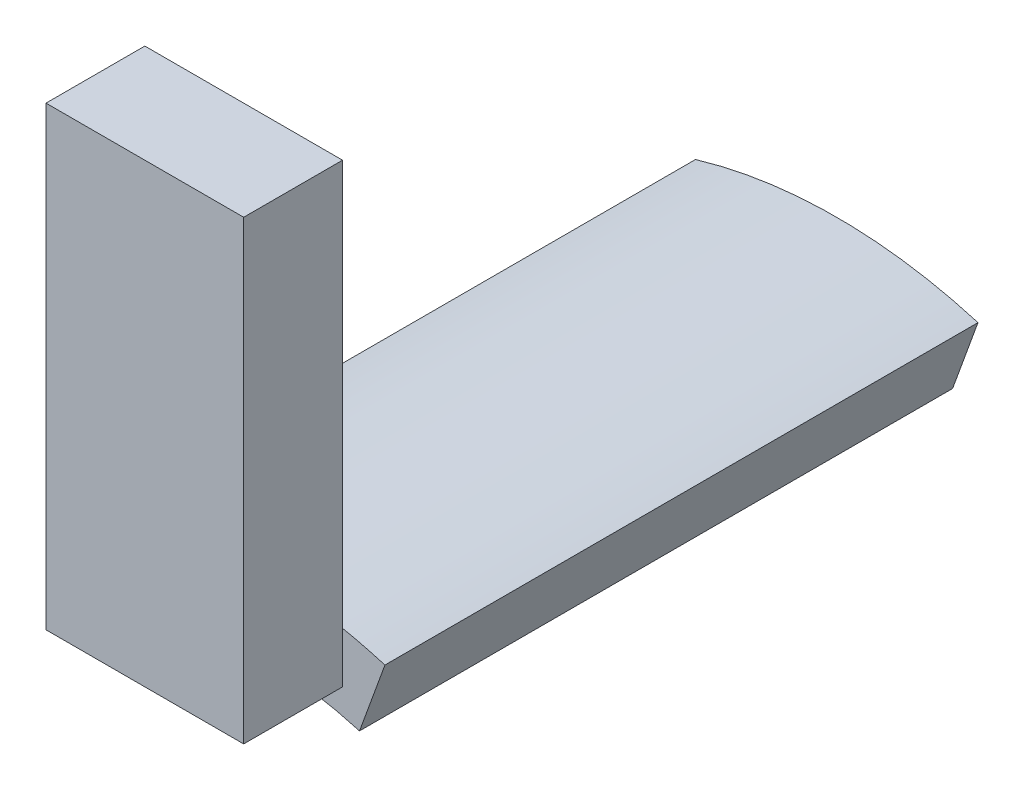
ISO-10303-21;
HEADER;
FILE_DESCRIPTION(('STEP AP214'),'2;1');
FILE_NAME('part.step','',(''),(''),'','','');
FILE_SCHEMA(('AUTOMOTIVE_DESIGN { 1 0 10303 214 1 1 1 1 }'));
ENDSEC;
DATA;
#1=APPLICATION_CONTEXT('core data for automotive mechanical design processes');
#2=APPLICATION_PROTOCOL_DEFINITION('international standard','automotive_design',2000,#1);
#3=PRODUCT_CONTEXT('',#1,'mechanical');
#4=PRODUCT('Part','Part','',(#3));
#5=PRODUCT_RELATED_PRODUCT_CATEGORY('part','',(#4));
#6=PRODUCT_DEFINITION_FORMATION('','',#4);
#7=PRODUCT_DEFINITION_CONTEXT('part definition',#1,'design');
#8=PRODUCT_DEFINITION('design','',#6,#7);
#9=PRODUCT_DEFINITION_SHAPE('','',#8);
#10=(LENGTH_UNIT() NAMED_UNIT(*) SI_UNIT(.MILLI.,.METRE.));
#11=(NAMED_UNIT(*) PLANE_ANGLE_UNIT() SI_UNIT($,.RADIAN.));
#12=(NAMED_UNIT(*) SI_UNIT($,.STERADIAN.) SOLID_ANGLE_UNIT());
#13=UNCERTAINTY_MEASURE_WITH_UNIT(LENGTH_MEASURE(1.E-05),#10,'distance_accuracy_value','');
#14=(GEOMETRIC_REPRESENTATION_CONTEXT(3) GLOBAL_UNCERTAINTY_ASSIGNED_CONTEXT((#13)) GLOBAL_UNIT_ASSIGNED_CONTEXT((#10,
#11,#12)) REPRESENTATION_CONTEXT('',''));
#15=CARTESIAN_POINT('',(0.,0.,0.));
#16=DIRECTION('',(0.,0.,1.));
#17=DIRECTION('',(1.,0.,0.));
#18=AXIS2_PLACEMENT_3D('',#15,#16,#17);
#19=CARTESIAN_POINT('',(0.,0.,9.00097098619775));
#20=DIRECTION('',(0.,0.,-1.));
#21=DIRECTION('',(-1.,0.,0.));
#22=AXIS2_PLACEMENT_3D('',#19,#20,#21);
#23=CYLINDRICAL_SURFACE('',#22,5.);
#24=CARTESIAN_POINT('',(0.,0.,6.));
#25=DIRECTION('',(0.,0.,1.));
#26=DIRECTION('',(1.,0.,0.));
#27=AXIS2_PLACEMENT_3D('',#24,#25,#26);
#28=CIRCLE('',#27,5.);
#29=CARTESIAN_POINT('',(1.42907027322848,4.79142548248167,6.));
#30=VERTEX_POINT('',#29);
#31=CARTESIAN_POINT('',(1.,4.89897948556636,6.));
#32=VERTEX_POINT('',#31);
#33=EDGE_CURVE('E103',#30,#32,#28,.T.);
#34=ORIENTED_EDGE('',*,*,#33,.F.);
#35=DIRECTION('',(0.,0.,-1.));
#36=VECTOR('',#35,1.);
#37=CARTESIAN_POINT('',(1.42907027322848,4.79142548248167,9.00097098619775));
#38=LINE('',#37,#36);
#39=CARTESIAN_POINT('',(1.42907027322848,4.79142548248167,0.));
#40=VERTEX_POINT('',#39);
#41=EDGE_CURVE('E35',#30,#40,#38,.T.);
#42=ORIENTED_EDGE('',*,*,#41,.T.);
#43=CARTESIAN_POINT('',(0.,0.,0.));
#44=DIRECTION('',(0.,0.,1.));
#45=DIRECTION('',(1.,0.,0.));
#46=AXIS2_PLACEMENT_3D('',#43,#44,#45);
#47=CIRCLE('',#46,5.);
#48=CARTESIAN_POINT('',(-1.42907027322848,4.79142548248167,0.));
#49=VERTEX_POINT('',#48);
#50=EDGE_CURVE('E143',#40,#49,#47,.T.);
#51=ORIENTED_EDGE('',*,*,#50,.T.);
#52=DIRECTION('',(0.,0.,-1.));
#53=VECTOR('',#52,1.);
#54=CARTESIAN_POINT('',(-1.42907027322848,4.79142548248167,9.00097098619775));
#55=LINE('',#54,#53);
#56=CARTESIAN_POINT('',(-1.42907027322848,4.79142548248167,6.));
#57=VERTEX_POINT('',#56);
#58=EDGE_CURVE('E142',#57,#49,#55,.T.);
#59=ORIENTED_EDGE('',*,*,#58,.F.);
#60=CARTESIAN_POINT('',(-1.,4.89897948556636,6.));
#61=VERTEX_POINT('',#60);
#62=EDGE_CURVE('E153',#61,#57,#28,.T.);
#63=ORIENTED_EDGE('',*,*,#62,.F.);
#64=EDGE_CURVE('E152',#32,#61,#28,.T.);
#65=ORIENTED_EDGE('',*,*,#64,.F.);
#66=EDGE_LOOP('',(#34,#42,#51,#59,#63,#65));
#67=FACE_BOUND('',#66,.T.);
#68=ADVANCED_FACE('F31',(#67),#23,.T.);
#69=CARTESIAN_POINT('',(-1.42907027322848,4.79142548248167,9.00097098619775));
#70=DIRECTION('',(0.939692620785908,0.34202014332567,0.));
#71=DIRECTION('',(-0.34202014332567,0.939692620785908,0.));
#72=AXIS2_PLACEMENT_3D('',#69,#70,#71);
#73=PLANE('',#72);
#74=DIRECTION('',(0.34202014332567,-0.939692620785908,0.));
#75=VECTOR('',#74,1.);
#76=CARTESIAN_POINT('',(-1.42907027322848,4.79142548248167,6.));
#77=LINE('',#76,#75);
#78=CARTESIAN_POINT('',(-1.17202513205037,4.08519976131429,6.));
#79=VERTEX_POINT('',#78);
#80=EDGE_CURVE('E148',#57,#79,#77,.T.);
#81=ORIENTED_EDGE('',*,*,#80,.F.);
#82=ORIENTED_EDGE('',*,*,#58,.T.);
#83=DIRECTION('',(0.34202014332567,-0.939692620785908,0.));
#84=VECTOR('',#83,1.);
#85=CARTESIAN_POINT('',(-1.42907027322848,4.79142548248167,0.));
#86=LINE('',#85,#84);
#87=CARTESIAN_POINT('',(-1.17202513205037,4.08519976131429,0.));
#88=VERTEX_POINT('',#87);
#89=EDGE_CURVE('E139',#49,#88,#86,.T.);
#90=ORIENTED_EDGE('',*,*,#89,.T.);
#91=DIRECTION('',(0.,0.,-1.));
#92=VECTOR('',#91,1.);
#93=CARTESIAN_POINT('',(-1.17202513205037,4.08519976131429,9.00097098619775));
#94=LINE('',#93,#92);
#95=EDGE_CURVE('E138',#79,#88,#94,.T.);
#96=ORIENTED_EDGE('',*,*,#95,.F.);
#97=EDGE_LOOP('',(#81,#82,#90,#96));
#98=FACE_BOUND('',#97,.T.);
#99=ADVANCED_FACE('F173',(#98),#73,.F.);
#100=CARTESIAN_POINT('',(0.,0.,9.00097098619775));
#101=DIRECTION('',(0.,0.,-1.));
#102=DIRECTION('',(-1.,0.,0.));
#103=AXIS2_PLACEMENT_3D('',#100,#101,#102);
#104=CYLINDRICAL_SURFACE('',#103,4.25);
#105=CARTESIAN_POINT('',(0.,0.,6.));
#106=DIRECTION('',(0.,0.,1.));
#107=DIRECTION('',(1.,0.,0.));
#108=AXIS2_PLACEMENT_3D('',#105,#106,#107);
#109=CIRCLE('',#108,4.25);
#110=CARTESIAN_POINT('',(1.17202513205037,4.08519976131429,6.));
#111=VERTEX_POINT('',#110);
#112=EDGE_CURVE('E40',#79,#111,#109,.F.);
#113=ORIENTED_EDGE('',*,*,#112,.F.);
#114=ORIENTED_EDGE('',*,*,#95,.T.);
#115=CARTESIAN_POINT('',(0.,0.,0.));
#116=DIRECTION('',(0.,0.,-1.));
#117=DIRECTION('',(1.,0.,0.));
#118=AXIS2_PLACEMENT_3D('',#115,#116,#117);
#119=CIRCLE('',#118,4.25);
#120=CARTESIAN_POINT('',(1.17202513205037,4.08519976131429,0.));
#121=VERTEX_POINT('',#120);
#122=EDGE_CURVE('E135',#88,#121,#119,.T.);
#123=ORIENTED_EDGE('',*,*,#122,.T.);
#124=DIRECTION('',(0.,0.,-1.));
#125=VECTOR('',#124,1.);
#126=CARTESIAN_POINT('',(1.17202513205037,4.08519976131429,9.00097098619775));
#127=LINE('',#126,#125);
#128=EDGE_CURVE('E134',#111,#121,#127,.T.);
#129=ORIENTED_EDGE('',*,*,#128,.F.);
#130=EDGE_LOOP('',(#113,#114,#123,#129));
#131=FACE_BOUND('',#130,.T.);
#132=ADVANCED_FACE('F163',(#131),#104,.F.);
#133=CARTESIAN_POINT('',(1.17202513205037,4.08519976131429,9.00097098619775));
#134=DIRECTION('',(-0.939692620785908,0.342020143325669,0.));
#135=DIRECTION('',(-0.342020143325669,-0.939692620785908,0.));
#136=AXIS2_PLACEMENT_3D('',#133,#134,#135);
#137=PLANE('',#136);
#138=DIRECTION('',(0.342020143325669,0.939692620785908,0.));
#139=VECTOR('',#138,1.);
#140=CARTESIAN_POINT('',(1.17202513205037,4.08519976131429,6.));
#141=LINE('',#140,#139);
#142=EDGE_CURVE('E133',#111,#30,#141,.T.);
#143=ORIENTED_EDGE('',*,*,#142,.F.);
#144=ORIENTED_EDGE('',*,*,#128,.T.);
#145=DIRECTION('',(0.342020143325669,0.939692620785908,0.));
#146=VECTOR('',#145,1.);
#147=CARTESIAN_POINT('',(1.17202513205037,4.08519976131429,0.));
#148=LINE('',#147,#146);
#149=EDGE_CURVE('E130',#121,#40,#148,.T.);
#150=ORIENTED_EDGE('',*,*,#149,.T.);
#151=ORIENTED_EDGE('',*,*,#41,.F.);
#152=EDGE_LOOP('',(#143,#144,#150,#151));
#153=FACE_BOUND('',#152,.T.);
#154=ADVANCED_FACE('F158',(#153),#137,.F.);
#155=CARTESIAN_POINT('',(0.,0.,0.));
#156=DIRECTION('',(0.,0.,1.));
#157=DIRECTION('',(1.,0.,0.));
#158=AXIS2_PLACEMENT_3D('',#155,#156,#157);
#159=PLANE('',#158);
#160=ORIENTED_EDGE('',*,*,#50,.F.);
#161=ORIENTED_EDGE('',*,*,#149,.F.);
#162=ORIENTED_EDGE('',*,*,#122,.F.);
#163=ORIENTED_EDGE('',*,*,#89,.F.);
#164=EDGE_LOOP('',(#160,#161,#162,#163));
#165=FACE_BOUND('',#164,.T.);
#166=ADVANCED_FACE('F167',(#165),#159,.F.);
#167=CARTESIAN_POINT('',(0.,0.,6.));
#168=DIRECTION('',(0.,0.,1.));
#169=DIRECTION('',(1.,0.,0.));
#170=AXIS2_PLACEMENT_3D('',#167,#168,#169);
#171=PLANE('',#170);
#172=DIRECTION('',(0.,-1.,0.));
#173=VECTOR('',#172,1.);
#174=CARTESIAN_POINT('',(-1.,4.38519976131429,6.));
#175=LINE('',#174,#173);
#176=CARTESIAN_POINT('',(-1.,4.38519976131429,6.));
#177=VERTEX_POINT('',#176);
#178=EDGE_CURVE('E11',#61,#177,#175,.T.);
#179=ORIENTED_EDGE('',*,*,#178,.F.);
#180=ORIENTED_EDGE('',*,*,#62,.T.);
#181=ORIENTED_EDGE('',*,*,#80,.T.);
#182=ORIENTED_EDGE('',*,*,#112,.T.);
#183=ORIENTED_EDGE('',*,*,#142,.T.);
#184=ORIENTED_EDGE('',*,*,#33,.T.);
#185=DIRECTION('',(0.,1.,0.));
#186=VECTOR('',#185,1.);
#187=CARTESIAN_POINT('',(1.,4.38519976131429,6.));
#188=LINE('',#187,#186);
#189=CARTESIAN_POINT('',(1.,4.38519976131429,6.));
#190=VERTEX_POINT('',#189);
#191=EDGE_CURVE('E100',#190,#32,#188,.T.);
#192=ORIENTED_EDGE('',*,*,#191,.F.);
#193=DIRECTION('',(1.,0.,0.));
#194=VECTOR('',#193,1.);
#195=CARTESIAN_POINT('',(-1.,4.38519976131429,6.));
#196=LINE('',#195,#194);
#197=EDGE_CURVE('E49',#177,#190,#196,.T.);
#198=ORIENTED_EDGE('',*,*,#197,.F.);
#199=EDGE_LOOP('',(#179,#180,#181,#182,#183,#184,#192,#198));
#200=FACE_BOUND('',#199,.T.);
#201=ADVANCED_FACE('F33',(#200),#171,.T.);
#202=CARTESIAN_POINT('',(-1.,4.38519976131429,7.));
#203=DIRECTION('',(1.,0.,0.));
#204=DIRECTION('',(0.,0.,-1.));
#205=AXIS2_PLACEMENT_3D('',#202,#203,#204);
#206=PLANE('',#205);
#207=CARTESIAN_POINT('',(-1.,9.,6.));
#208=VERTEX_POINT('',#207);
#209=EDGE_CURVE('E42',#208,#61,#175,.T.);
#210=ORIENTED_EDGE('',*,*,#209,.T.);
#211=ORIENTED_EDGE('',*,*,#178,.T.);
#212=DIRECTION('',(0.,0.,-1.));
#213=VECTOR('',#212,1.);
#214=CARTESIAN_POINT('',(-1.,4.38519976131429,7.));
#215=LINE('',#214,#213);
#216=CARTESIAN_POINT('',(-1.,4.38519976131429,7.));
#217=VERTEX_POINT('',#216);
#218=EDGE_CURVE('E117',#217,#177,#215,.T.);
#219=ORIENTED_EDGE('',*,*,#218,.F.);
#220=DIRECTION('',(0.,-1.,0.));
#221=VECTOR('',#220,1.);
#222=CARTESIAN_POINT('',(-1.,4.38519976131429,7.));
#223=LINE('',#222,#221);
#224=CARTESIAN_POINT('',(-1.,9.,7.));
#225=VERTEX_POINT('',#224);
#226=EDGE_CURVE('E212',#225,#217,#223,.T.);
#227=ORIENTED_EDGE('',*,*,#226,.F.);
#228=DIRECTION('',(0.,0.,-1.));
#229=VECTOR('',#228,1.);
#230=CARTESIAN_POINT('',(-1.,9.,7.));
#231=LINE('',#230,#229);
#232=EDGE_CURVE('E126',#225,#208,#231,.T.);
#233=ORIENTED_EDGE('',*,*,#232,.T.);
#234=EDGE_LOOP('',(#210,#211,#219,#227,#233));
#235=FACE_BOUND('',#234,.T.);
#236=ADVANCED_FACE('F186',(#235),#206,.F.);
#237=CARTESIAN_POINT('',(-1.,4.38519976131429,7.));
#238=DIRECTION('',(0.,1.,0.));
#239=DIRECTION('',(0.,0.,1.));
#240=AXIS2_PLACEMENT_3D('',#237,#238,#239);
#241=PLANE('',#240);
#242=ORIENTED_EDGE('',*,*,#197,.T.);
#243=DIRECTION('',(0.,0.,-1.));
#244=VECTOR('',#243,1.);
#245=CARTESIAN_POINT('',(1.,4.38519976131429,7.));
#246=LINE('',#245,#244);
#247=CARTESIAN_POINT('',(1.,4.38519976131429,7.));
#248=VERTEX_POINT('',#247);
#249=EDGE_CURVE('E114',#248,#190,#246,.T.);
#250=ORIENTED_EDGE('',*,*,#249,.F.);
#251=DIRECTION('',(1.,0.,0.));
#252=VECTOR('',#251,1.);
#253=CARTESIAN_POINT('',(-1.,4.38519976131429,7.));
#254=LINE('',#253,#252);
#255=EDGE_CURVE('E215',#217,#248,#254,.T.);
#256=ORIENTED_EDGE('',*,*,#255,.F.);
#257=ORIENTED_EDGE('',*,*,#218,.T.);
#258=EDGE_LOOP('',(#242,#250,#256,#257));
#259=FACE_BOUND('',#258,.T.);
#260=ADVANCED_FACE('F113',(#259),#241,.F.);
#261=CARTESIAN_POINT('',(1.,4.38519976131429,7.));
#262=DIRECTION('',(-1.,0.,0.));
#263=DIRECTION('',(0.,0.,1.));
#264=AXIS2_PLACEMENT_3D('',#261,#262,#263);
#265=PLANE('',#264);
#266=ORIENTED_EDGE('',*,*,#191,.T.);
#267=CARTESIAN_POINT('',(1.,9.,6.));
#268=VERTEX_POINT('',#267);
#269=EDGE_CURVE('E108',#32,#268,#188,.T.);
#270=ORIENTED_EDGE('',*,*,#269,.T.);
#271=DIRECTION('',(0.,0.,-1.));
#272=VECTOR('',#271,1.);
#273=CARTESIAN_POINT('',(1.,9.,7.));
#274=LINE('',#273,#272);
#275=CARTESIAN_POINT('',(1.,9.,7.));
#276=VERTEX_POINT('',#275);
#277=EDGE_CURVE('E122',#276,#268,#274,.T.);
#278=ORIENTED_EDGE('',*,*,#277,.F.);
#279=DIRECTION('',(0.,1.,0.));
#280=VECTOR('',#279,1.);
#281=CARTESIAN_POINT('',(1.,4.38519976131429,7.));
#282=LINE('',#281,#280);
#283=EDGE_CURVE('E121',#248,#276,#282,.T.);
#284=ORIENTED_EDGE('',*,*,#283,.F.);
#285=ORIENTED_EDGE('',*,*,#249,.T.);
#286=EDGE_LOOP('',(#266,#270,#278,#284,#285));
#287=FACE_BOUND('',#286,.T.);
#288=ADVANCED_FACE('F119',(#287),#265,.F.);
#289=CARTESIAN_POINT('',(-1.,9.,7.));
#290=DIRECTION('',(0.,-1.,0.));
#291=DIRECTION('',(0.,0.,-1.));
#292=AXIS2_PLACEMENT_3D('',#289,#290,#291);
#293=PLANE('',#292);
#294=DIRECTION('',(-1.,0.,0.));
#295=VECTOR('',#294,1.);
#296=CARTESIAN_POINT('',(-1.,9.,6.));
#297=LINE('',#296,#295);
#298=EDGE_CURVE('E107',#268,#208,#297,.T.);
#299=ORIENTED_EDGE('',*,*,#298,.T.);
#300=ORIENTED_EDGE('',*,*,#232,.F.);
#301=DIRECTION('',(-1.,0.,0.));
#302=VECTOR('',#301,1.);
#303=CARTESIAN_POINT('',(-1.,9.,7.));
#304=LINE('',#303,#302);
#305=EDGE_CURVE('E218',#276,#225,#304,.T.);
#306=ORIENTED_EDGE('',*,*,#305,.F.);
#307=ORIENTED_EDGE('',*,*,#277,.T.);
#308=EDGE_LOOP('',(#299,#300,#306,#307));
#309=FACE_BOUND('',#308,.T.);
#310=ADVANCED_FACE('F194',(#309),#293,.F.);
#311=CARTESIAN_POINT('',(-1.,9.,7.));
#312=DIRECTION('',(0.,0.,-1.));
#313=DIRECTION('',(-1.,0.,0.));
#314=AXIS2_PLACEMENT_3D('',#311,#312,#313);
#315=PLANE('',#314);
#316=ORIENTED_EDGE('',*,*,#226,.T.);
#317=ORIENTED_EDGE('',*,*,#255,.T.);
#318=ORIENTED_EDGE('',*,*,#283,.T.);
#319=ORIENTED_EDGE('',*,*,#305,.T.);
#320=EDGE_LOOP('',(#316,#317,#318,#319));
#321=FACE_BOUND('',#320,.T.);
#322=ADVANCED_FACE('F197',(#321),#315,.F.);
#323=CARTESIAN_POINT('',(-1.,9.,6.));
#324=DIRECTION('',(0.,0.,-1.));
#325=DIRECTION('',(-1.,0.,0.));
#326=AXIS2_PLACEMENT_3D('',#323,#324,#325);
#327=PLANE('',#326);
#328=ORIENTED_EDGE('',*,*,#269,.F.);
#329=ORIENTED_EDGE('',*,*,#64,.T.);
#330=ORIENTED_EDGE('',*,*,#209,.F.);
#331=ORIENTED_EDGE('',*,*,#298,.F.);
#332=EDGE_LOOP('',(#328,#329,#330,#331));
#333=FACE_BOUND('',#332,.T.);
#334=ADVANCED_FACE('F201',(#333),#327,.T.);
#335=CLOSED_SHELL('',(#68,#99,#132,#154,#166,#201,#236,#260,#288,#310,#322,#334));
#336=MANIFOLD_SOLID_BREP('B2',#335);
#337=ADVANCED_BREP_SHAPE_REPRESENTATION('',(#18,#336),#14);
#338=SHAPE_DEFINITION_REPRESENTATION(#9,#337);
ENDSEC;
END-ISO-10303-21;
